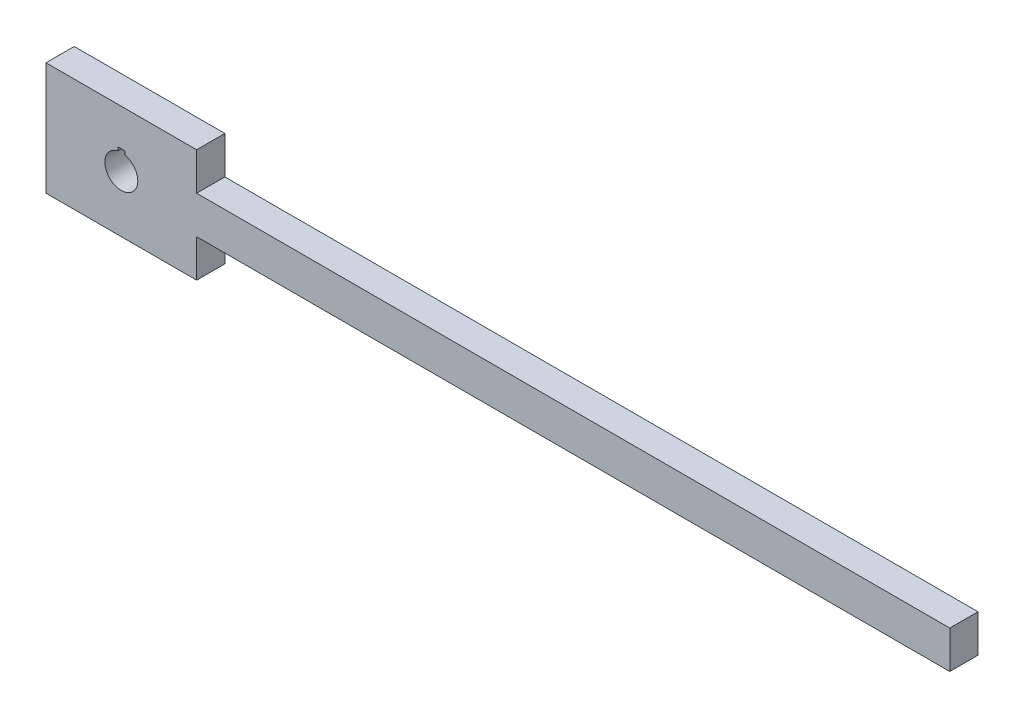
ISO-10303-21;
HEADER;
FILE_DESCRIPTION(('STEP AP214'),'2;1');
FILE_NAME('part.step','',(''),(''),'','','');
FILE_SCHEMA(('AUTOMOTIVE_DESIGN { 1 0 10303 214 1 1 1 1 }'));
ENDSEC;
DATA;
#1=APPLICATION_CONTEXT('core data for automotive mechanical design processes');
#2=APPLICATION_PROTOCOL_DEFINITION('international standard','automotive_design',2000,#1);
#3=PRODUCT_CONTEXT('',#1,'mechanical');
#4=PRODUCT('Part','Part','',(#3));
#5=PRODUCT_RELATED_PRODUCT_CATEGORY('part','',(#4));
#6=PRODUCT_DEFINITION_FORMATION('','',#4);
#7=PRODUCT_DEFINITION_CONTEXT('part definition',#1,'design');
#8=PRODUCT_DEFINITION('design','',#6,#7);
#9=PRODUCT_DEFINITION_SHAPE('','',#8);
#10=(LENGTH_UNIT() NAMED_UNIT(*) SI_UNIT(.MILLI.,.METRE.));
#11=(NAMED_UNIT(*) PLANE_ANGLE_UNIT() SI_UNIT($,.RADIAN.));
#12=(NAMED_UNIT(*) SI_UNIT($,.STERADIAN.) SOLID_ANGLE_UNIT());
#13=UNCERTAINTY_MEASURE_WITH_UNIT(LENGTH_MEASURE(1.E-05),#10,'distance_accuracy_value','');
#14=(GEOMETRIC_REPRESENTATION_CONTEXT(3) GLOBAL_UNCERTAINTY_ASSIGNED_CONTEXT((#13)) GLOBAL_UNIT_ASSIGNED_CONTEXT((#10,
#11,#12)) REPRESENTATION_CONTEXT('',''));
#15=CARTESIAN_POINT('',(0.,0.,0.));
#16=DIRECTION('',(0.,0.,1.));
#17=DIRECTION('',(1.,0.,0.));
#18=AXIS2_PLACEMENT_3D('',#15,#16,#17);
#19=CARTESIAN_POINT('',(36.3837837837838,23.3405405405405,19.05));
#20=DIRECTION('',(0.,-1.,0.));
#21=DIRECTION('',(0.,0.,-1.));
#22=AXIS2_PLACEMENT_3D('',#19,#20,#21);
#23=PLANE('',#22);
#24=DIRECTION('',(-1.,0.,0.));
#25=VECTOR('',#24,1.);
#26=CARTESIAN_POINT('',(36.3837837837838,23.3405405405405,0.));
#27=LINE('',#26,#25);
#28=CARTESIAN_POINT('',(36.3837837837838,23.3405405405405,0.));
#29=VERTEX_POINT('',#28);
#30=CARTESIAN_POINT('',(-65.2162162162162,23.3405405405405,0.));
#31=VERTEX_POINT('',#30);
#32=EDGE_CURVE('E171',#29,#31,#27,.T.);
#33=ORIENTED_EDGE('',*,*,#32,.T.);
#34=DIRECTION('',(0.,0.,-1.));
#35=VECTOR('',#34,1.);
#36=CARTESIAN_POINT('',(-65.2162162162162,23.3405405405405,19.05));
#37=LINE('',#36,#35);
#38=CARTESIAN_POINT('',(-65.2162162162162,23.3405405405405,19.05));
#39=VERTEX_POINT('',#38);
#40=EDGE_CURVE('E11',#39,#31,#37,.T.);
#41=ORIENTED_EDGE('',*,*,#40,.F.);
#42=DIRECTION('',(-1.,0.,0.));
#43=VECTOR('',#42,1.);
#44=CARTESIAN_POINT('',(36.3837837837838,23.3405405405405,19.05));
#45=LINE('',#44,#43);
#46=CARTESIAN_POINT('',(36.3837837837838,23.3405405405405,19.05));
#47=VERTEX_POINT('',#46);
#48=EDGE_CURVE('E177',#47,#39,#45,.T.);
#49=ORIENTED_EDGE('',*,*,#48,.F.);
#50=DIRECTION('',(0.,0.,-1.));
#51=VECTOR('',#50,1.);
#52=CARTESIAN_POINT('',(36.3837837837838,23.3405405405405,19.05));
#53=LINE('',#52,#51);
#54=EDGE_CURVE('E203',#47,#29,#53,.T.);
#55=ORIENTED_EDGE('',*,*,#54,.T.);
#56=EDGE_LOOP('',(#33,#41,#49,#55));
#57=FACE_BOUND('',#56,.T.);
#58=ADVANCED_FACE('F39',(#57),#23,.F.);
#59=CARTESIAN_POINT('',(-65.2162162162162,23.3405405405405,19.05));
#60=DIRECTION('',(1.,0.,0.));
#61=DIRECTION('',(0.,0.,-1.));
#62=AXIS2_PLACEMENT_3D('',#59,#60,#61);
#63=PLANE('',#62);
#64=DIRECTION('',(0.,-1.,0.));
#65=VECTOR('',#64,1.);
#66=CARTESIAN_POINT('',(-65.2162162162162,23.3405405405405,0.));
#67=LINE('',#66,#65);
#68=CARTESIAN_POINT('',(-65.2162162162162,-52.8594594594595,0.));
#69=VERTEX_POINT('',#68);
#70=EDGE_CURVE('E207',#31,#69,#67,.T.);
#71=ORIENTED_EDGE('',*,*,#70,.T.);
#72=DIRECTION('',(0.,0.,-1.));
#73=VECTOR('',#72,1.);
#74=CARTESIAN_POINT('',(-65.2162162162162,-52.8594594594595,19.05));
#75=LINE('',#74,#73);
#76=CARTESIAN_POINT('',(-65.2162162162162,-52.8594594594595,19.05));
#77=VERTEX_POINT('',#76);
#78=EDGE_CURVE('E47',#77,#69,#75,.T.);
#79=ORIENTED_EDGE('',*,*,#78,.F.);
#80=DIRECTION('',(0.,-1.,0.));
#81=VECTOR('',#80,1.);
#82=CARTESIAN_POINT('',(-65.2162162162162,23.3405405405405,19.05));
#83=LINE('',#82,#81);
#84=EDGE_CURVE('E181',#39,#77,#83,.T.);
#85=ORIENTED_EDGE('',*,*,#84,.F.);
#86=ORIENTED_EDGE('',*,*,#40,.T.);
#87=EDGE_LOOP('',(#71,#79,#85,#86));
#88=FACE_BOUND('',#87,.T.);
#89=ADVANCED_FACE('F276',(#88),#63,.F.);
#90=CARTESIAN_POINT('',(-65.2162162162162,-52.8594594594595,19.05));
#91=DIRECTION('',(0.,1.,0.));
#92=DIRECTION('',(-1.,0.,0.));
#93=AXIS2_PLACEMENT_3D('',#90,#91,#92);
#94=PLANE('',#93);
#95=DIRECTION('',(1.,0.,0.));
#96=VECTOR('',#95,1.);
#97=CARTESIAN_POINT('',(-65.2162162162162,-52.8594594594595,0.));
#98=LINE('',#97,#96);
#99=CARTESIAN_POINT('',(36.3837837837838,-52.8594594594594,0.));
#100=VERTEX_POINT('',#99);
#101=EDGE_CURVE('E210',#69,#100,#98,.T.);
#102=ORIENTED_EDGE('',*,*,#101,.T.);
#103=DIRECTION('',(0.,0.,-1.));
#104=VECTOR('',#103,1.);
#105=CARTESIAN_POINT('',(36.3837837837838,-52.8594594594594,19.05));
#106=LINE('',#105,#104);
#107=CARTESIAN_POINT('',(36.3837837837838,-52.8594594594594,19.05));
#108=VERTEX_POINT('',#107);
#109=EDGE_CURVE('E246',#108,#100,#106,.T.);
#110=ORIENTED_EDGE('',*,*,#109,.F.);
#111=DIRECTION('',(1.,0.,0.));
#112=VECTOR('',#111,1.);
#113=CARTESIAN_POINT('',(-65.2162162162162,-52.8594594594595,19.05));
#114=LINE('',#113,#112);
#115=EDGE_CURVE('E185',#77,#108,#114,.T.);
#116=ORIENTED_EDGE('',*,*,#115,.F.);
#117=ORIENTED_EDGE('',*,*,#78,.T.);
#118=EDGE_LOOP('',(#102,#110,#116,#117));
#119=FACE_BOUND('',#118,.T.);
#120=ADVANCED_FACE('F255',(#119),#94,.F.);
#121=CARTESIAN_POINT('',(36.3837837837838,-52.8594594594594,19.05));
#122=DIRECTION('',(-1.,0.,0.));
#123=DIRECTION('',(0.,0.,1.));
#124=AXIS2_PLACEMENT_3D('',#121,#122,#123);
#125=PLANE('',#124);
#126=DIRECTION('',(0.,1.,0.));
#127=VECTOR('',#126,1.);
#128=CARTESIAN_POINT('',(36.3837837837838,-52.8594594594594,0.));
#129=LINE('',#128,#127);
#130=CARTESIAN_POINT('',(36.3837837837838,-27.4594594594594,0.));
#131=VERTEX_POINT('',#130);
#132=EDGE_CURVE('E213',#100,#131,#129,.T.);
#133=ORIENTED_EDGE('',*,*,#132,.T.);
#134=DIRECTION('',(0.,0.,-1.));
#135=VECTOR('',#134,1.);
#136=CARTESIAN_POINT('',(36.3837837837838,-27.4594594594594,19.05));
#137=LINE('',#136,#135);
#138=CARTESIAN_POINT('',(36.3837837837838,-27.4594594594594,19.05));
#139=VERTEX_POINT('',#138);
#140=EDGE_CURVE('E242',#139,#131,#137,.T.);
#141=ORIENTED_EDGE('',*,*,#140,.F.);
#142=DIRECTION('',(0.,1.,0.));
#143=VECTOR('',#142,1.);
#144=CARTESIAN_POINT('',(36.3837837837838,-52.8594594594594,19.05));
#145=LINE('',#144,#143);
#146=EDGE_CURVE('E188',#108,#139,#145,.T.);
#147=ORIENTED_EDGE('',*,*,#146,.F.);
#148=ORIENTED_EDGE('',*,*,#109,.T.);
#149=EDGE_LOOP('',(#133,#141,#147,#148));
#150=FACE_BOUND('',#149,.T.);
#151=ADVANCED_FACE('F264',(#150),#125,.F.);
#152=CARTESIAN_POINT('',(36.3837837837838,-27.4594594594594,19.05));
#153=DIRECTION('',(0.,1.,0.));
#154=DIRECTION('',(-1.,0.,0.));
#155=AXIS2_PLACEMENT_3D('',#152,#153,#154);
#156=PLANE('',#155);
#157=DIRECTION('',(1.,0.,0.));
#158=VECTOR('',#157,1.);
#159=CARTESIAN_POINT('',(36.3837837837838,-27.4594594594594,0.));
#160=LINE('',#159,#158);
#161=CARTESIAN_POINT('',(544.383783783784,-27.4594594594593,0.));
#162=VERTEX_POINT('',#161);
#163=EDGE_CURVE('E216',#131,#162,#160,.T.);
#164=ORIENTED_EDGE('',*,*,#163,.T.);
#165=DIRECTION('',(0.,0.,-1.));
#166=VECTOR('',#165,1.);
#167=CARTESIAN_POINT('',(544.383783783784,-27.4594594594593,19.05));
#168=LINE('',#167,#166);
#169=CARTESIAN_POINT('',(544.383783783784,-27.4594594594593,19.05));
#170=VERTEX_POINT('',#169);
#171=EDGE_CURVE('E238',#170,#162,#168,.T.);
#172=ORIENTED_EDGE('',*,*,#171,.F.);
#173=DIRECTION('',(1.,0.,0.));
#174=VECTOR('',#173,1.);
#175=CARTESIAN_POINT('',(36.3837837837838,-27.4594594594594,19.05));
#176=LINE('',#175,#174);
#177=EDGE_CURVE('E191',#139,#170,#176,.T.);
#178=ORIENTED_EDGE('',*,*,#177,.F.);
#179=ORIENTED_EDGE('',*,*,#140,.T.);
#180=EDGE_LOOP('',(#164,#172,#178,#179));
#181=FACE_BOUND('',#180,.T.);
#182=ADVANCED_FACE('F268',(#181),#156,.F.);
#183=CARTESIAN_POINT('',(544.383783783784,-27.4594594594593,19.05));
#184=DIRECTION('',(-1.,0.,0.));
#185=DIRECTION('',(0.,0.,1.));
#186=AXIS2_PLACEMENT_3D('',#183,#184,#185);
#187=PLANE('',#186);
#188=DIRECTION('',(0.,1.,0.));
#189=VECTOR('',#188,1.);
#190=CARTESIAN_POINT('',(544.383783783784,-27.4594594594593,0.));
#191=LINE('',#190,#189);
#192=CARTESIAN_POINT('',(544.383783783784,-2.05945945945935,0.));
#193=VERTEX_POINT('',#192);
#194=EDGE_CURVE('E219',#162,#193,#191,.T.);
#195=ORIENTED_EDGE('',*,*,#194,.T.);
#196=DIRECTION('',(0.,0.,-1.));
#197=VECTOR('',#196,1.);
#198=CARTESIAN_POINT('',(544.383783783784,-2.05945945945935,19.05));
#199=LINE('',#198,#197);
#200=CARTESIAN_POINT('',(544.383783783784,-2.05945945945935,19.05));
#201=VERTEX_POINT('',#200);
#202=EDGE_CURVE('E234',#201,#193,#199,.T.);
#203=ORIENTED_EDGE('',*,*,#202,.F.);
#204=DIRECTION('',(0.,1.,0.));
#205=VECTOR('',#204,1.);
#206=CARTESIAN_POINT('',(544.383783783784,-27.4594594594593,19.05));
#207=LINE('',#206,#205);
#208=EDGE_CURVE('E194',#170,#201,#207,.T.);
#209=ORIENTED_EDGE('',*,*,#208,.F.);
#210=ORIENTED_EDGE('',*,*,#171,.T.);
#211=EDGE_LOOP('',(#195,#203,#209,#210));
#212=FACE_BOUND('',#211,.T.);
#213=ADVANCED_FACE('F289',(#212),#187,.F.);
#214=CARTESIAN_POINT('',(544.383783783784,-2.05945945945935,19.05));
#215=DIRECTION('',(0.,-1.,0.));
#216=DIRECTION('',(1.,0.,0.));
#217=AXIS2_PLACEMENT_3D('',#214,#215,#216);
#218=PLANE('',#217);
#219=DIRECTION('',(-1.,0.,0.));
#220=VECTOR('',#219,1.);
#221=CARTESIAN_POINT('',(544.383783783784,-2.05945945945935,0.));
#222=LINE('',#221,#220);
#223=CARTESIAN_POINT('',(36.3837837837837,-2.05945945945944,0.));
#224=VERTEX_POINT('',#223);
#225=EDGE_CURVE('E222',#193,#224,#222,.T.);
#226=ORIENTED_EDGE('',*,*,#225,.T.);
#227=DIRECTION('',(0.,0.,-1.));
#228=VECTOR('',#227,1.);
#229=CARTESIAN_POINT('',(36.3837837837837,-2.05945945945944,19.05));
#230=LINE('',#229,#228);
#231=CARTESIAN_POINT('',(36.3837837837837,-2.05945945945944,19.05));
#232=VERTEX_POINT('',#231);
#233=EDGE_CURVE('E230',#232,#224,#230,.T.);
#234=ORIENTED_EDGE('',*,*,#233,.F.);
#235=DIRECTION('',(-1.,0.,0.));
#236=VECTOR('',#235,1.);
#237=CARTESIAN_POINT('',(544.383783783784,-2.05945945945935,19.05));
#238=LINE('',#237,#236);
#239=EDGE_CURVE('E197',#201,#232,#238,.T.);
#240=ORIENTED_EDGE('',*,*,#239,.F.);
#241=ORIENTED_EDGE('',*,*,#202,.T.);
#242=EDGE_LOOP('',(#226,#234,#240,#241));
#243=FACE_BOUND('',#242,.T.);
#244=ADVANCED_FACE('F287',(#243),#218,.F.);
#245=CARTESIAN_POINT('',(36.3837837837837,-2.05945945945944,19.05));
#246=DIRECTION('',(-1.,0.,0.));
#247=DIRECTION('',(0.,-1.,0.));
#248=AXIS2_PLACEMENT_3D('',#245,#246,#247);
#249=PLANE('',#248);
#250=DIRECTION('',(0.,1.,0.));
#251=VECTOR('',#250,1.);
#252=CARTESIAN_POINT('',(36.3837837837837,-2.05945945945944,0.));
#253=LINE('',#252,#251);
#254=EDGE_CURVE('E182',#224,#29,#253,.T.);
#255=ORIENTED_EDGE('',*,*,#254,.T.);
#256=ORIENTED_EDGE('',*,*,#54,.F.);
#257=DIRECTION('',(0.,1.,0.));
#258=VECTOR('',#257,1.);
#259=CARTESIAN_POINT('',(36.3837837837837,-2.05945945945944,19.05));
#260=LINE('',#259,#258);
#261=EDGE_CURVE('E200',#232,#47,#260,.T.);
#262=ORIENTED_EDGE('',*,*,#261,.F.);
#263=ORIENTED_EDGE('',*,*,#233,.T.);
#264=EDGE_LOOP('',(#255,#256,#262,#263));
#265=FACE_BOUND('',#264,.T.);
#266=ADVANCED_FACE('F282',(#265),#249,.F.);
#267=CARTESIAN_POINT('',(0.,0.,19.05));
#268=DIRECTION('',(0.,0.,1.));
#269=DIRECTION('',(1.,0.,0.));
#270=AXIS2_PLACEMENT_3D('',#267,#268,#269);
#271=PLANE('',#270);
#272=CARTESIAN_POINT('',(-14.4162162162162,-14.7594594594594,19.05));
#273=DIRECTION('',(0.,0.,1.));
#274=DIRECTION('',(1.,0.,0.));
#275=AXIS2_PLACEMENT_3D('',#272,#273,#274);
#276=CIRCLE('',#275,11.1125);
#277=CARTESIAN_POINT('',(-16.8006412162162,-3.90578848280943,19.05));
#278=VERTEX_POINT('',#277);
#279=CARTESIAN_POINT('',(-12.0375702565538,-3.90452050760064,19.05));
#280=VERTEX_POINT('',#279);
#281=EDGE_CURVE('E54',#278,#280,#276,.T.);
#282=ORIENTED_EDGE('',*,*,#281,.F.);
#283=DIRECTION('',(0.,-1.,0.));
#284=VECTOR('',#283,1.);
#285=CARTESIAN_POINT('',(-16.8006412162162,-3.90578848280943,19.05));
#286=LINE('',#285,#284);
#287=CARTESIAN_POINT('',(-16.8006412162162,-1.52453848280944,19.05));
#288=VERTEX_POINT('',#287);
#289=EDGE_CURVE('E149',#288,#278,#286,.T.);
#290=ORIENTED_EDGE('',*,*,#289,.F.);
#291=DIRECTION('',(-1.,0.,0.));
#292=VECTOR('',#291,1.);
#293=CARTESIAN_POINT('',(-12.0381412162162,-1.52453848280944,19.05));
#294=LINE('',#293,#292);
#295=CARTESIAN_POINT('',(-12.0381412162162,-1.52453848280944,19.05));
#296=VERTEX_POINT('',#295);
#297=EDGE_CURVE('E153',#296,#288,#294,.T.);
#298=ORIENTED_EDGE('',*,*,#297,.F.);
#299=DIRECTION('',(-0.000239900822798989,0.999999971223797,0.));
#300=VECTOR('',#299,1.);
#301=CARTESIAN_POINT('',(-12.0375702565538,-3.90452050760064,19.05));
#302=LINE('',#301,#300);
#303=EDGE_CURVE('E162',#280,#296,#302,.T.);
#304=ORIENTED_EDGE('',*,*,#303,.F.);
#305=EDGE_LOOP('',(#282,#290,#298,#304));
#306=FACE_BOUND('',#305,.T.);
#307=ORIENTED_EDGE('',*,*,#48,.T.);
#308=ORIENTED_EDGE('',*,*,#84,.T.);
#309=ORIENTED_EDGE('',*,*,#115,.T.);
#310=ORIENTED_EDGE('',*,*,#146,.T.);
#311=ORIENTED_EDGE('',*,*,#177,.T.);
#312=ORIENTED_EDGE('',*,*,#208,.T.);
#313=ORIENTED_EDGE('',*,*,#239,.T.);
#314=ORIENTED_EDGE('',*,*,#261,.T.);
#315=EDGE_LOOP('',(#307,#308,#309,#310,#311,#312,#313,#314));
#316=FACE_BOUND('',#315,.T.);
#317=ADVANCED_FACE('F272',(#306,#316),#271,.T.);
#318=CARTESIAN_POINT('',(0.,0.,0.));
#319=DIRECTION('',(0.,0.,1.));
#320=DIRECTION('',(1.,0.,0.));
#321=AXIS2_PLACEMENT_3D('',#318,#319,#320);
#322=PLANE('',#321);
#323=DIRECTION('',(0.,-1.,0.));
#324=VECTOR('',#323,1.);
#325=CARTESIAN_POINT('',(-16.8006412162162,-3.90578848280943,0.));
#326=LINE('',#325,#324);
#327=CARTESIAN_POINT('',(-16.8006412162162,-1.52453848280944,0.));
#328=VERTEX_POINT('',#327);
#329=CARTESIAN_POINT('',(-16.8006412162162,-3.90578848280943,0.));
#330=VERTEX_POINT('',#329);
#331=EDGE_CURVE('E137',#328,#330,#326,.T.);
#332=ORIENTED_EDGE('',*,*,#331,.T.);
#333=CARTESIAN_POINT('',(-14.4162162162162,-14.7594594594594,0.));
#334=DIRECTION('',(0.,0.,1.));
#335=DIRECTION('',(1.,0.,0.));
#336=AXIS2_PLACEMENT_3D('',#333,#334,#335);
#337=CIRCLE('',#336,11.1125);
#338=CARTESIAN_POINT('',(-12.0375702565538,-3.90452050760064,0.));
#339=VERTEX_POINT('',#338);
#340=EDGE_CURVE('E130',#330,#339,#337,.T.);
#341=ORIENTED_EDGE('',*,*,#340,.T.);
#342=DIRECTION('',(-0.000239900822798989,0.999999971223797,0.));
#343=VECTOR('',#342,1.);
#344=CARTESIAN_POINT('',(-12.0375702565538,-3.90452050760064,0.));
#345=LINE('',#344,#343);
#346=CARTESIAN_POINT('',(-12.0381412162162,-1.52453848280944,0.));
#347=VERTEX_POINT('',#346);
#348=EDGE_CURVE('E140',#339,#347,#345,.T.);
#349=ORIENTED_EDGE('',*,*,#348,.T.);
#350=DIRECTION('',(-1.,0.,0.));
#351=VECTOR('',#350,1.);
#352=CARTESIAN_POINT('',(-12.0381412162162,-1.52453848280944,0.));
#353=LINE('',#352,#351);
#354=EDGE_CURVE('E62',#347,#328,#353,.T.);
#355=ORIENTED_EDGE('',*,*,#354,.T.);
#356=EDGE_LOOP('',(#332,#341,#349,#355));
#357=FACE_BOUND('',#356,.T.);
#358=ORIENTED_EDGE('',*,*,#32,.F.);
#359=ORIENTED_EDGE('',*,*,#254,.F.);
#360=ORIENTED_EDGE('',*,*,#225,.F.);
#361=ORIENTED_EDGE('',*,*,#194,.F.);
#362=ORIENTED_EDGE('',*,*,#163,.F.);
#363=ORIENTED_EDGE('',*,*,#132,.F.);
#364=ORIENTED_EDGE('',*,*,#101,.F.);
#365=ORIENTED_EDGE('',*,*,#70,.F.);
#366=EDGE_LOOP('',(#358,#359,#360,#361,#362,#363,#364,#365));
#367=FACE_BOUND('',#366,.T.);
#368=ADVANCED_FACE('F145',(#357,#367),#322,.F.);
#369=CARTESIAN_POINT('',(-14.4162162162162,-14.7594594594594,0.));
#370=DIRECTION('',(0.,0.,1.));
#371=DIRECTION('',(1.,0.,0.));
#372=AXIS2_PLACEMENT_3D('',#369,#370,#371);
#373=CYLINDRICAL_SURFACE('',#372,11.1125);
#374=ORIENTED_EDGE('',*,*,#281,.T.);
#375=DIRECTION('',(0.,0.,1.));
#376=VECTOR('',#375,1.);
#377=CARTESIAN_POINT('',(-12.0375702565538,-3.90452050760064,0.));
#378=LINE('',#377,#376);
#379=EDGE_CURVE('E126',#339,#280,#378,.T.);
#380=ORIENTED_EDGE('',*,*,#379,.F.);
#381=ORIENTED_EDGE('',*,*,#340,.F.);
#382=DIRECTION('',(0.,0.,1.));
#383=VECTOR('',#382,1.);
#384=CARTESIAN_POINT('',(-16.8006412162162,-3.90578848280943,0.));
#385=LINE('',#384,#383);
#386=EDGE_CURVE('E168',#330,#278,#385,.T.);
#387=ORIENTED_EDGE('',*,*,#386,.T.);
#388=EDGE_LOOP('',(#374,#380,#381,#387));
#389=FACE_BOUND('',#388,.T.);
#390=ADVANCED_FACE('F128',(#389),#373,.F.);
#391=CARTESIAN_POINT('',(-16.8006412162162,-3.90578848280943,0.));
#392=DIRECTION('',(-1.,0.,0.));
#393=DIRECTION('',(0.,0.,1.));
#394=AXIS2_PLACEMENT_3D('',#391,#392,#393);
#395=PLANE('',#394);
#396=ORIENTED_EDGE('',*,*,#289,.T.);
#397=ORIENTED_EDGE('',*,*,#386,.F.);
#398=ORIENTED_EDGE('',*,*,#331,.F.);
#399=DIRECTION('',(0.,0.,1.));
#400=VECTOR('',#399,1.);
#401=CARTESIAN_POINT('',(-16.8006412162162,-1.52453848280944,0.));
#402=LINE('',#401,#400);
#403=EDGE_CURVE('E172',#328,#288,#402,.T.);
#404=ORIENTED_EDGE('',*,*,#403,.T.);
#405=EDGE_LOOP('',(#396,#397,#398,#404));
#406=FACE_BOUND('',#405,.T.);
#407=ADVANCED_FACE('F360',(#406),#395,.F.);
#408=CARTESIAN_POINT('',(-12.0381412162162,-1.52453848280944,0.));
#409=DIRECTION('',(0.,1.,0.));
#410=DIRECTION('',(-1.,0.,0.));
#411=AXIS2_PLACEMENT_3D('',#408,#409,#410);
#412=PLANE('',#411);
#413=ORIENTED_EDGE('',*,*,#297,.T.);
#414=ORIENTED_EDGE('',*,*,#403,.F.);
#415=ORIENTED_EDGE('',*,*,#354,.F.);
#416=DIRECTION('',(0.,0.,1.));
#417=VECTOR('',#416,1.);
#418=CARTESIAN_POINT('',(-12.0381412162162,-1.52453848280944,0.));
#419=LINE('',#418,#417);
#420=EDGE_CURVE('E136',#347,#296,#419,.T.);
#421=ORIENTED_EDGE('',*,*,#420,.T.);
#422=EDGE_LOOP('',(#413,#414,#415,#421));
#423=FACE_BOUND('',#422,.T.);
#424=ADVANCED_FACE('F369',(#423),#412,.F.);
#425=CARTESIAN_POINT('',(-12.0375702565538,-3.90452050760064,0.));
#426=DIRECTION('',(0.999999971223797,0.000239900822798989,0.));
#427=DIRECTION('',(-0.000239900822798989,0.999999971223797,0.));
#428=AXIS2_PLACEMENT_3D('',#425,#426,#427);
#429=PLANE('',#428);
#430=ORIENTED_EDGE('',*,*,#303,.T.);
#431=ORIENTED_EDGE('',*,*,#420,.F.);
#432=ORIENTED_EDGE('',*,*,#348,.F.);
#433=ORIENTED_EDGE('',*,*,#379,.T.);
#434=EDGE_LOOP('',(#430,#431,#432,#433));
#435=FACE_BOUND('',#434,.T.);
#436=ADVANCED_FACE('F141',(#435),#429,.F.);
#437=CLOSED_SHELL('',(#58,#89,#120,#151,#182,#213,#244,#266,#317,#368,#390,#407,#424,#436));
#438=MANIFOLD_SOLID_BREP('B2',#437);
#439=ADVANCED_BREP_SHAPE_REPRESENTATION('',(#18,#438),#14);
#440=SHAPE_DEFINITION_REPRESENTATION(#9,#439);
ENDSEC;
END-ISO-10303-21;
